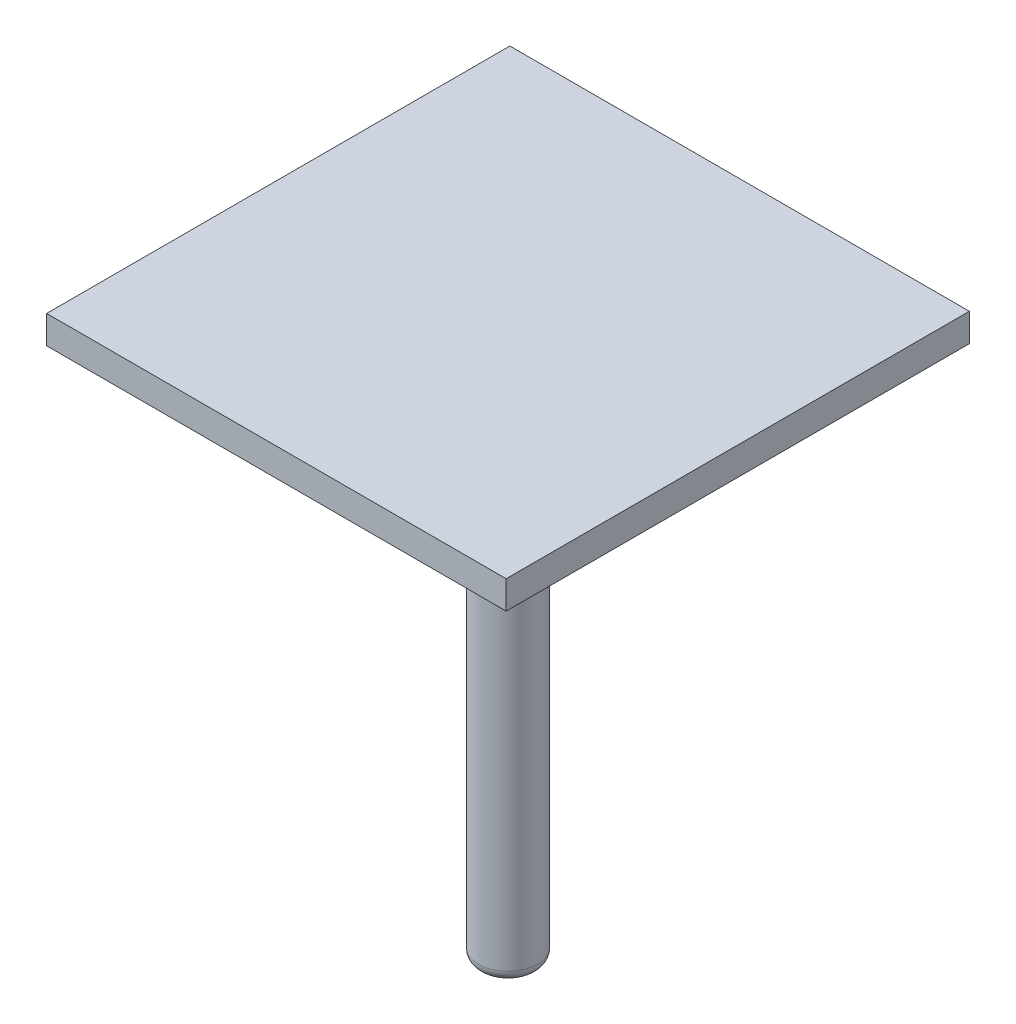
ISO-10303-21;
HEADER;
FILE_DESCRIPTION(('STEP AP214'),'2;1');
FILE_NAME('part.step','',(''),(''),'','','');
FILE_SCHEMA(('AUTOMOTIVE_DESIGN { 1 0 10303 214 1 1 1 1 }'));
ENDSEC;
DATA;
#1=APPLICATION_CONTEXT('core data for automotive mechanical design processes');
#2=APPLICATION_PROTOCOL_DEFINITION('international standard','automotive_design',2000,#1);
#3=PRODUCT_CONTEXT('',#1,'mechanical');
#4=PRODUCT('Part','Part','',(#3));
#5=PRODUCT_RELATED_PRODUCT_CATEGORY('part','',(#4));
#6=PRODUCT_DEFINITION_FORMATION('','',#4);
#7=PRODUCT_DEFINITION_CONTEXT('part definition',#1,'design');
#8=PRODUCT_DEFINITION('design','',#6,#7);
#9=PRODUCT_DEFINITION_SHAPE('','',#8);
#10=(LENGTH_UNIT() NAMED_UNIT(*) SI_UNIT(.MILLI.,.METRE.));
#11=(NAMED_UNIT(*) PLANE_ANGLE_UNIT() SI_UNIT($,.RADIAN.));
#12=(NAMED_UNIT(*) SI_UNIT($,.STERADIAN.) SOLID_ANGLE_UNIT());
#13=UNCERTAINTY_MEASURE_WITH_UNIT(LENGTH_MEASURE(1.E-05),#10,'distance_accuracy_value','');
#14=(GEOMETRIC_REPRESENTATION_CONTEXT(3) GLOBAL_UNCERTAINTY_ASSIGNED_CONTEXT((#13)) GLOBAL_UNIT_ASSIGNED_CONTEXT((#10,
#11,#12)) REPRESENTATION_CONTEXT('',''));
#15=CARTESIAN_POINT('',(0.,0.,0.));
#16=DIRECTION('',(0.,0.,1.));
#17=DIRECTION('',(1.,0.,0.));
#18=AXIS2_PLACEMENT_3D('',#15,#16,#17);
#19=CARTESIAN_POINT('',(0.,16.5,0.));
#20=DIRECTION('',(0.,-1.,0.));
#21=DIRECTION('',(0.,0.,-1.));
#22=AXIS2_PLACEMENT_3D('',#19,#20,#21);
#23=CYLINDRICAL_SURFACE('',#22,1.05);
#24=CARTESIAN_POINT('',(0.,0.400000000000001,0.));
#25=DIRECTION('',(0.,1.,0.));
#26=DIRECTION('',(0.,0.,1.));
#27=AXIS2_PLACEMENT_3D('',#24,#25,#26);
#28=CIRCLE('',#27,1.05);
#29=CARTESIAN_POINT('',(0.,0.400000000000001,1.05));
#30=VERTEX_POINT('',#29);
#31=EDGE_CURVE('E136',#30,#30,#28,.T.);
#32=ORIENTED_EDGE('',*,*,#31,.T.);
#33=EDGE_LOOP('',(#32));
#34=FACE_BOUND('',#33,.T.);
#35=CARTESIAN_POINT('',(0.,16.5,0.));
#36=DIRECTION('',(0.,1.,0.));
#37=DIRECTION('',(0.,0.,1.));
#38=AXIS2_PLACEMENT_3D('',#35,#36,#37);
#39=CIRCLE('',#38,1.05);
#40=CARTESIAN_POINT('',(0.,16.5,1.05));
#41=VERTEX_POINT('',#40);
#42=EDGE_CURVE('E132',#41,#41,#39,.T.);
#43=ORIENTED_EDGE('',*,*,#42,.F.);
#44=EDGE_LOOP('',(#43));
#45=FACE_BOUND('',#44,.T.);
#46=ADVANCED_FACE('F39',(#34,#45),#23,.T.);
#47=CARTESIAN_POINT('',(0.,0.,0.));
#48=DIRECTION('',(0.,1.,0.));
#49=DIRECTION('',(0.,0.,1.));
#50=AXIS2_PLACEMENT_3D('',#47,#48,#49);
#51=PLANE('',#50);
#52=CARTESIAN_POINT('',(0.,0.,0.));
#53=DIRECTION('',(0.,1.,0.));
#54=DIRECTION('',(0.,0.,1.));
#55=AXIS2_PLACEMENT_3D('',#52,#53,#54);
#56=CIRCLE('',#55,0.65);
#57=CARTESIAN_POINT('',(0.,0.,0.65));
#58=VERTEX_POINT('',#57);
#59=EDGE_CURVE('E140',#58,#58,#56,.F.);
#60=ORIENTED_EDGE('',*,*,#59,.T.);
#61=EDGE_LOOP('',(#60));
#62=FACE_BOUND('',#61,.T.);
#63=ADVANCED_FACE('F164',(#62),#51,.F.);
#64=CARTESIAN_POINT('',(0.,19.,0.));
#65=DIRECTION('',(0.,-1.,0.));
#66=DIRECTION('',(0.,0.,-1.));
#67=AXIS2_PLACEMENT_3D('',#64,#65,#66);
#68=CYLINDRICAL_SURFACE('',#67,2.);
#69=CARTESIAN_POINT('',(0.,18.,0.));
#70=DIRECTION('',(0.,1.,0.));
#71=DIRECTION('',(0.,0.,1.));
#72=AXIS2_PLACEMENT_3D('',#69,#70,#71);
#73=CIRCLE('',#72,2.);
#74=CARTESIAN_POINT('',(0.,18.,2.));
#75=VERTEX_POINT('',#74);
#76=EDGE_CURVE('E11',#75,#75,#73,.F.);
#77=ORIENTED_EDGE('',*,*,#76,.T.);
#78=EDGE_LOOP('',(#77));
#79=FACE_BOUND('',#78,.T.);
#80=CARTESIAN_POINT('',(0.,16.5,0.));
#81=DIRECTION('',(0.,1.,0.));
#82=DIRECTION('',(0.,0.,1.));
#83=AXIS2_PLACEMENT_3D('',#80,#81,#82);
#84=CIRCLE('',#83,2.);
#85=CARTESIAN_POINT('',(0.,16.5,2.));
#86=VERTEX_POINT('',#85);
#87=EDGE_CURVE('E128',#86,#86,#84,.T.);
#88=ORIENTED_EDGE('',*,*,#87,.T.);
#89=EDGE_LOOP('',(#88));
#90=FACE_BOUND('',#89,.T.);
#91=ADVANCED_FACE('F170',(#79,#90),#68,.T.);
#92=CARTESIAN_POINT('',(0.,16.5,0.));
#93=DIRECTION('',(0.,1.,0.));
#94=DIRECTION('',(0.,0.,1.));
#95=AXIS2_PLACEMENT_3D('',#92,#93,#94);
#96=PLANE('',#95);
#97=ORIENTED_EDGE('',*,*,#42,.T.);
#98=EDGE_LOOP('',(#97));
#99=FACE_BOUND('',#98,.T.);
#100=ORIENTED_EDGE('',*,*,#87,.F.);
#101=EDGE_LOOP('',(#100));
#102=FACE_BOUND('',#101,.T.);
#103=ADVANCED_FACE('F160',(#99,#102),#96,.F.);
#104=CARTESIAN_POINT('',(0.,0.400000000000001,0.));
#105=DIRECTION('',(0.,1.,0.));
#106=DIRECTION('',(0.,0.,1.));
#107=AXIS2_PLACEMENT_3D('',#104,#105,#106);
#108=TOROIDAL_SURFACE('',#107,0.65,0.4);
#109=ORIENTED_EDGE('',*,*,#59,.F.);
#110=EDGE_LOOP('',(#109));
#111=FACE_BOUND('',#110,.T.);
#112=ORIENTED_EDGE('',*,*,#31,.F.);
#113=EDGE_LOOP('',(#112));
#114=FACE_BOUND('',#113,.T.);
#115=ADVANCED_FACE('F152',(#111,#114),#108,.T.);
#116=CARTESIAN_POINT('',(0.,18.,0.));
#117=DIRECTION('',(0.,1.,0.));
#118=DIRECTION('',(0.,0.,1.));
#119=AXIS2_PLACEMENT_3D('',#116,#117,#118);
#120=DEGENERATE_TOROIDAL_SURFACE('',#119,1.,1.,.T.);
#121=ORIENTED_EDGE('',*,*,#76,.F.);
#122=EDGE_LOOP('',(#121));
#123=FACE_BOUND('',#122,.T.);
#124=CARTESIAN_POINT('',(0.,19.,0.));
#125=DIRECTION('',(0.,1.,0.));
#126=DIRECTION('',(0.,0.,1.));
#127=AXIS2_PLACEMENT_3D('',#124,#125,#126);
#128=CIRCLE('',#127,1.);
#129=CARTESIAN_POINT('',(0.,19.,1.));
#130=VERTEX_POINT('',#129);
#131=EDGE_CURVE('E49',#130,#130,#128,.T.);
#132=ORIENTED_EDGE('',*,*,#131,.F.);
#133=EDGE_LOOP('',(#132));
#134=FACE_BOUND('',#133,.T.);
#135=ADVANCED_FACE('F41',(#123,#134),#120,.T.);
#136=CARTESIAN_POINT('',(8.18981249469089,20.,8.25590892730041));
#137=DIRECTION('',(-1.,0.,0.));
#138=DIRECTION('',(0.,0.,1.));
#139=AXIS2_PLACEMENT_3D('',#136,#137,#138);
#140=PLANE('',#139);
#141=DIRECTION('',(0.,0.,-1.));
#142=VECTOR('',#141,1.);
#143=CARTESIAN_POINT('',(8.18981249469089,19.,8.25590892730041));
#144=LINE('',#143,#142);
#145=CARTESIAN_POINT('',(8.18981249469089,19.,8.25590892730041));
#146=VERTEX_POINT('',#145);
#147=CARTESIAN_POINT('',(8.18981249469089,19.,-8.25590892730041));
#148=VERTEX_POINT('',#147);
#149=EDGE_CURVE('E112',#146,#148,#144,.T.);
#150=ORIENTED_EDGE('',*,*,#149,.T.);
#151=DIRECTION('',(0.,-1.,0.));
#152=VECTOR('',#151,1.);
#153=CARTESIAN_POINT('',(8.18981249469089,20.,-8.25590892730041));
#154=LINE('',#153,#152);
#155=CARTESIAN_POINT('',(8.18981249469089,20.,-8.25590892730041));
#156=VERTEX_POINT('',#155);
#157=EDGE_CURVE('E101',#156,#148,#154,.T.);
#158=ORIENTED_EDGE('',*,*,#157,.F.);
#159=DIRECTION('',(0.,0.,-1.));
#160=VECTOR('',#159,1.);
#161=CARTESIAN_POINT('',(8.18981249469089,20.,8.25590892730041));
#162=LINE('',#161,#160);
#163=CARTESIAN_POINT('',(8.18981249469089,20.,8.25590892730041));
#164=VERTEX_POINT('',#163);
#165=EDGE_CURVE('E93',#164,#156,#162,.T.);
#166=ORIENTED_EDGE('',*,*,#165,.F.);
#167=DIRECTION('',(0.,-1.,0.));
#168=VECTOR('',#167,1.);
#169=CARTESIAN_POINT('',(8.18981249469089,20.,8.25590892730041));
#170=LINE('',#169,#168);
#171=EDGE_CURVE('E108',#164,#146,#170,.T.);
#172=ORIENTED_EDGE('',*,*,#171,.T.);
#173=EDGE_LOOP('',(#150,#158,#166,#172));
#174=FACE_BOUND('',#173,.T.);
#175=ADVANCED_FACE('F151',(#174),#140,.F.);
#176=CARTESIAN_POINT('',(-8.18981249469089,20.,-8.25590892730041));
#177=DIRECTION('',(0.,0.,1.));
#178=DIRECTION('',(1.,0.,0.));
#179=AXIS2_PLACEMENT_3D('',#176,#177,#178);
#180=PLANE('',#179);
#181=DIRECTION('',(-1.,0.,0.));
#182=VECTOR('',#181,1.);
#183=CARTESIAN_POINT('',(-8.18981249469089,19.,-8.25590892730041));
#184=LINE('',#183,#182);
#185=CARTESIAN_POINT('',(-8.18981249469089,19.,-8.25590892730041));
#186=VERTEX_POINT('',#185);
#187=EDGE_CURVE('E99',#148,#186,#184,.T.);
#188=ORIENTED_EDGE('',*,*,#187,.T.);
#189=DIRECTION('',(0.,-1.,0.));
#190=VECTOR('',#189,1.);
#191=CARTESIAN_POINT('',(-8.18981249469089,20.,-8.25590892730041));
#192=LINE('',#191,#190);
#193=CARTESIAN_POINT('',(-8.18981249469089,20.,-8.25590892730041));
#194=VERTEX_POINT('',#193);
#195=EDGE_CURVE('E97',#194,#186,#192,.T.);
#196=ORIENTED_EDGE('',*,*,#195,.F.);
#197=DIRECTION('',(-1.,0.,0.));
#198=VECTOR('',#197,1.);
#199=CARTESIAN_POINT('',(-8.18981249469089,20.,-8.25590892730041));
#200=LINE('',#199,#198);
#201=EDGE_CURVE('E88',#156,#194,#200,.T.);
#202=ORIENTED_EDGE('',*,*,#201,.F.);
#203=ORIENTED_EDGE('',*,*,#157,.T.);
#204=EDGE_LOOP('',(#188,#196,#202,#203));
#205=FACE_BOUND('',#204,.T.);
#206=ADVANCED_FACE('F98',(#205),#180,.F.);
#207=CARTESIAN_POINT('',(-8.18981249469089,20.,8.25590892730041));
#208=DIRECTION('',(1.,0.,0.));
#209=DIRECTION('',(0.,0.,-1.));
#210=AXIS2_PLACEMENT_3D('',#207,#208,#209);
#211=PLANE('',#210);
#212=DIRECTION('',(0.,0.,1.));
#213=VECTOR('',#212,1.);
#214=CARTESIAN_POINT('',(-8.18981249469089,19.,8.25590892730041));
#215=LINE('',#214,#213);
#216=CARTESIAN_POINT('',(-8.18981249469089,19.,8.25590892730041));
#217=VERTEX_POINT('',#216);
#218=EDGE_CURVE('E74',#186,#217,#215,.T.);
#219=ORIENTED_EDGE('',*,*,#218,.T.);
#220=DIRECTION('',(0.,-1.,0.));
#221=VECTOR('',#220,1.);
#222=CARTESIAN_POINT('',(-8.18981249469089,20.,8.25590892730041));
#223=LINE('',#222,#221);
#224=CARTESIAN_POINT('',(-8.18981249469089,20.,8.25590892730041));
#225=VERTEX_POINT('',#224);
#226=EDGE_CURVE('E102',#225,#217,#223,.T.);
#227=ORIENTED_EDGE('',*,*,#226,.F.);
#228=DIRECTION('',(0.,0.,1.));
#229=VECTOR('',#228,1.);
#230=CARTESIAN_POINT('',(-8.18981249469089,20.,8.25590892730041));
#231=LINE('',#230,#229);
#232=EDGE_CURVE('E91',#194,#225,#231,.T.);
#233=ORIENTED_EDGE('',*,*,#232,.F.);
#234=ORIENTED_EDGE('',*,*,#195,.T.);
#235=EDGE_LOOP('',(#219,#227,#233,#234));
#236=FACE_BOUND('',#235,.T.);
#237=ADVANCED_FACE('F104',(#236),#211,.F.);
#238=CARTESIAN_POINT('',(-8.18981249469089,20.,8.25590892730041));
#239=DIRECTION('',(0.,0.,-1.));
#240=DIRECTION('',(-1.,0.,0.));
#241=AXIS2_PLACEMENT_3D('',#238,#239,#240);
#242=PLANE('',#241);
#243=DIRECTION('',(1.,0.,0.));
#244=VECTOR('',#243,1.);
#245=CARTESIAN_POINT('',(-8.18981249469089,19.,8.25590892730041));
#246=LINE('',#245,#244);
#247=EDGE_CURVE('E80',#217,#146,#246,.T.);
#248=ORIENTED_EDGE('',*,*,#247,.T.);
#249=ORIENTED_EDGE('',*,*,#171,.F.);
#250=DIRECTION('',(1.,0.,0.));
#251=VECTOR('',#250,1.);
#252=CARTESIAN_POINT('',(-8.18981249469089,20.,8.25590892730041));
#253=LINE('',#252,#251);
#254=EDGE_CURVE('E57',#225,#164,#253,.T.);
#255=ORIENTED_EDGE('',*,*,#254,.F.);
#256=ORIENTED_EDGE('',*,*,#226,.T.);
#257=EDGE_LOOP('',(#248,#249,#255,#256));
#258=FACE_BOUND('',#257,.T.);
#259=ADVANCED_FACE('F185',(#258),#242,.F.);
#260=CARTESIAN_POINT('',(0.,20.,0.));
#261=DIRECTION('',(0.,-1.,0.));
#262=DIRECTION('',(0.,0.,-1.));
#263=AXIS2_PLACEMENT_3D('',#260,#261,#262);
#264=PLANE('',#263);
#265=ORIENTED_EDGE('',*,*,#165,.T.);
#266=ORIENTED_EDGE('',*,*,#201,.T.);
#267=ORIENTED_EDGE('',*,*,#232,.T.);
#268=ORIENTED_EDGE('',*,*,#254,.T.);
#269=EDGE_LOOP('',(#265,#266,#267,#268));
#270=FACE_BOUND('',#269,.T.);
#271=ADVANCED_FACE('F89',(#270),#264,.F.);
#272=CARTESIAN_POINT('',(0.,19.,0.));
#273=DIRECTION('',(0.,-1.,0.));
#274=DIRECTION('',(0.,0.,-1.));
#275=AXIS2_PLACEMENT_3D('',#272,#273,#274);
#276=PLANE('',#275);
#277=ORIENTED_EDGE('',*,*,#131,.T.);
#278=EDGE_LOOP('',(#277));
#279=FACE_BOUND('',#278,.T.);
#280=ORIENTED_EDGE('',*,*,#149,.F.);
#281=ORIENTED_EDGE('',*,*,#247,.F.);
#282=ORIENTED_EDGE('',*,*,#218,.F.);
#283=ORIENTED_EDGE('',*,*,#187,.F.);
#284=EDGE_LOOP('',(#280,#281,#282,#283));
#285=FACE_BOUND('',#284,.T.);
#286=ADVANCED_FACE('F147',(#279,#285),#276,.T.);
#287=CLOSED_SHELL('',(#46,#63,#91,#103,#115,#135,#175,#206,#237,#259,#271,#286));
#288=MANIFOLD_SOLID_BREP('B2',#287);
#289=ADVANCED_BREP_SHAPE_REPRESENTATION('',(#18,#288),#14);
#290=SHAPE_DEFINITION_REPRESENTATION(#9,#289);
ENDSEC;
END-ISO-10303-21;
